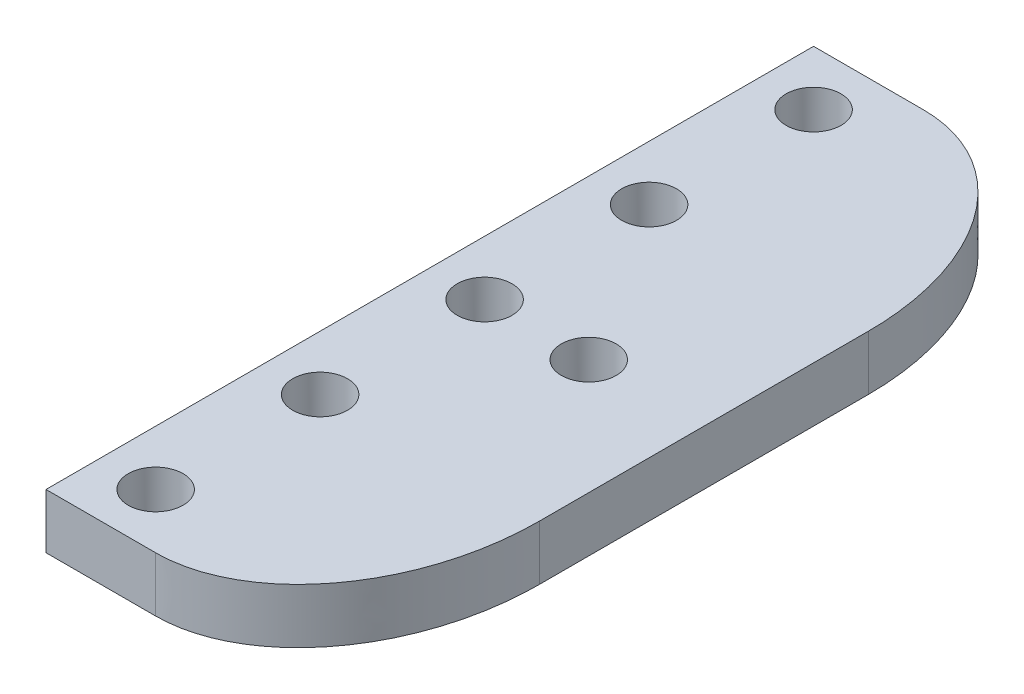
ISO-10303-21;
HEADER;
FILE_DESCRIPTION(('STEP AP214'),'2;1');
FILE_NAME('part.step','',(''),(''),'','','');
FILE_SCHEMA(('AUTOMOTIVE_DESIGN { 1 0 10303 214 1 1 1 1 }'));
ENDSEC;
DATA;
#1=APPLICATION_CONTEXT('core data for automotive mechanical design processes');
#2=APPLICATION_PROTOCOL_DEFINITION('international standard','automotive_design',2000,#1);
#3=PRODUCT_CONTEXT('',#1,'mechanical');
#4=PRODUCT('Part','Part','',(#3));
#5=PRODUCT_RELATED_PRODUCT_CATEGORY('part','',(#4));
#6=PRODUCT_DEFINITION_FORMATION('','',#4);
#7=PRODUCT_DEFINITION_CONTEXT('part definition',#1,'design');
#8=PRODUCT_DEFINITION('design','',#6,#7);
#9=PRODUCT_DEFINITION_SHAPE('','',#8);
#10=(LENGTH_UNIT() NAMED_UNIT(*) SI_UNIT(.MILLI.,.METRE.));
#11=(NAMED_UNIT(*) PLANE_ANGLE_UNIT() SI_UNIT($,.RADIAN.));
#12=(NAMED_UNIT(*) SI_UNIT($,.STERADIAN.) SOLID_ANGLE_UNIT());
#13=UNCERTAINTY_MEASURE_WITH_UNIT(LENGTH_MEASURE(1.E-05),#10,'distance_accuracy_value','');
#14=(GEOMETRIC_REPRESENTATION_CONTEXT(3) GLOBAL_UNCERTAINTY_ASSIGNED_CONTEXT((#13)) GLOBAL_UNIT_ASSIGNED_CONTEXT((#10,
#11,#12)) REPRESENTATION_CONTEXT('',''));
#15=CARTESIAN_POINT('',(0.,0.,0.));
#16=DIRECTION('',(0.,0.,1.));
#17=DIRECTION('',(1.,0.,0.));
#18=AXIS2_PLACEMENT_3D('',#15,#16,#17);
#19=CARTESIAN_POINT('',(12.5,-2.5,70.));
#20=DIRECTION('',(-1.,0.,0.));
#21=DIRECTION('',(0.,0.,1.));
#22=AXIS2_PLACEMENT_3D('',#19,#20,#21);
#23=PLANE('',#22);
#24=DIRECTION('',(0.,0.,-1.));
#25=VECTOR('',#24,1.);
#26=CARTESIAN_POINT('',(12.5,2.5,70.));
#27=LINE('',#26,#25);
#28=CARTESIAN_POINT('',(12.5,2.5,50.));
#29=VERTEX_POINT('',#28);
#30=CARTESIAN_POINT('',(12.5,2.5,20.));
#31=VERTEX_POINT('',#30);
#32=EDGE_CURVE('E120',#29,#31,#27,.T.);
#33=ORIENTED_EDGE('',*,*,#32,.F.);
#34=CARTESIAN_POINT('',(12.5,-2.75,50.));
#35=CARTESIAN_POINT('',(12.5,-0.916666666666667,50.));
#36=CARTESIAN_POINT('',(12.5,0.916666666666667,50.));
#37=CARTESIAN_POINT('',(12.5,2.75,50.));
#38=(BOUNDED_CURVE() B_SPLINE_CURVE(3,(#34,#35,#36,#37),.UNSPECIFIED.,.F.,
.F.) B_SPLINE_CURVE_WITH_KNOTS((4,4),(-0.00275,0.00275),
.UNSPECIFIED.) CURVE() GEOMETRIC_REPRESENTATION_ITEM() RATIONAL_B_SPLINE_CURVE((1.,1.,1.,1.)) REPRESENTATION_ITEM(''));
#39=CARTESIAN_POINT('',(12.5,-2.5,50.));
#40=VERTEX_POINT('',#39);
#41=EDGE_CURVE('E221',#29,#40,#38,.F.);
#42=ORIENTED_EDGE('',*,*,#41,.T.);
#43=DIRECTION('',(0.,0.,-1.));
#44=VECTOR('',#43,1.);
#45=CARTESIAN_POINT('',(12.5,-2.5,70.));
#46=LINE('',#45,#44);
#47=CARTESIAN_POINT('',(12.5,-2.5,20.));
#48=VERTEX_POINT('',#47);
#49=EDGE_CURVE('E128',#40,#48,#46,.T.);
#50=ORIENTED_EDGE('',*,*,#49,.T.);
#51=CARTESIAN_POINT('',(12.5,2.75,20.));
#52=CARTESIAN_POINT('',(12.5,0.916666666666669,20.));
#53=CARTESIAN_POINT('',(12.5,-0.916666666666669,20.));
#54=CARTESIAN_POINT('',(12.5,-2.75,20.));
#55=(BOUNDED_CURVE() B_SPLINE_CURVE(3,(#51,#52,#53,#54),.UNSPECIFIED.,.F.,
.F.) B_SPLINE_CURVE_WITH_KNOTS((4,4),(-0.00525,0.00025),
.UNSPECIFIED.) CURVE() GEOMETRIC_REPRESENTATION_ITEM() RATIONAL_B_SPLINE_CURVE((1.,1.,1.,1.)) REPRESENTATION_ITEM(''));
#56=EDGE_CURVE('E244',#48,#31,#55,.F.);
#57=ORIENTED_EDGE('',*,*,#56,.T.);
#58=EDGE_LOOP('',(#33,#42,#50,#57));
#59=FACE_BOUND('',#58,.T.);
#60=ADVANCED_FACE('F39',(#59),#23,.F.);
#61=CARTESIAN_POINT('',(-12.5,2.5,70.));
#62=DIRECTION('',(0.,-1.,0.));
#63=DIRECTION('',(0.,0.,-1.));
#64=AXIS2_PLACEMENT_3D('',#61,#62,#63);
#65=PLANE('',#64);
#66=CARTESIAN_POINT('',(-7.5,2.5,5.));
#67=DIRECTION('',(0.,-1.,0.));
#68=DIRECTION('',(0.,0.,-1.));
#69=AXIS2_PLACEMENT_3D('',#66,#67,#68);
#70=CIRCLE('',#69,2.5);
#71=CARTESIAN_POINT('',(-7.5,2.5,2.5));
#72=VERTEX_POINT('',#71);
#73=EDGE_CURVE('E321',#72,#72,#70,.T.);
#74=ORIENTED_EDGE('',*,*,#73,.T.);
#75=EDGE_LOOP('',(#74));
#76=FACE_BOUND('',#75,.T.);
#77=CARTESIAN_POINT('',(-7.5,2.5,35.));
#78=DIRECTION('',(0.,-1.,0.));
#79=DIRECTION('',(0.,0.,-1.));
#80=AXIS2_PLACEMENT_3D('',#77,#78,#79);
#81=CIRCLE('',#80,2.5);
#82=CARTESIAN_POINT('',(-7.5,2.5,32.5));
#83=VERTEX_POINT('',#82);
#84=EDGE_CURVE('E323',#83,#83,#81,.T.);
#85=ORIENTED_EDGE('',*,*,#84,.T.);
#86=EDGE_LOOP('',(#85));
#87=FACE_BOUND('',#86,.T.);
#88=CARTESIAN_POINT('',(-7.5,2.5,65.));
#89=DIRECTION('',(0.,-1.,0.));
#90=DIRECTION('',(0.,0.,-1.));
#91=AXIS2_PLACEMENT_3D('',#88,#89,#90);
#92=CIRCLE('',#91,2.5);
#93=CARTESIAN_POINT('',(-7.5,2.5,62.5));
#94=VERTEX_POINT('',#93);
#95=EDGE_CURVE('E326',#94,#94,#92,.T.);
#96=ORIENTED_EDGE('',*,*,#95,.T.);
#97=EDGE_LOOP('',(#96));
#98=FACE_BOUND('',#97,.T.);
#99=CARTESIAN_POINT('',(-7.5,2.5,50.));
#100=DIRECTION('',(0.,-1.,0.));
#101=DIRECTION('',(0.,0.,-1.));
#102=AXIS2_PLACEMENT_3D('',#99,#100,#101);
#103=CIRCLE('',#102,2.5);
#104=CARTESIAN_POINT('',(-7.5,2.5,47.5));
#105=VERTEX_POINT('',#104);
#106=EDGE_CURVE('E331',#105,#105,#103,.T.);
#107=ORIENTED_EDGE('',*,*,#106,.T.);
#108=EDGE_LOOP('',(#107));
#109=FACE_BOUND('',#108,.T.);
#110=CARTESIAN_POINT('',(2.,2.5,35.));
#111=DIRECTION('',(0.,-1.,0.));
#112=DIRECTION('',(0.,0.,-1.));
#113=AXIS2_PLACEMENT_3D('',#110,#111,#112);
#114=CIRCLE('',#113,2.5);
#115=CARTESIAN_POINT('',(2.,2.5,32.5));
#116=VERTEX_POINT('',#115);
#117=EDGE_CURVE('E334',#116,#116,#114,.T.);
#118=ORIENTED_EDGE('',*,*,#117,.T.);
#119=EDGE_LOOP('',(#118));
#120=FACE_BOUND('',#119,.T.);
#121=CARTESIAN_POINT('',(-7.5,2.5,20.));
#122=DIRECTION('',(0.,-1.,0.));
#123=DIRECTION('',(0.,0.,-1.));
#124=AXIS2_PLACEMENT_3D('',#121,#122,#123);
#125=CIRCLE('',#124,2.5);
#126=CARTESIAN_POINT('',(-7.5,2.5,17.5));
#127=VERTEX_POINT('',#126);
#128=EDGE_CURVE('E337',#127,#127,#125,.T.);
#129=ORIENTED_EDGE('',*,*,#128,.T.);
#130=EDGE_LOOP('',(#129));
#131=FACE_BOUND('',#130,.T.);
#132=DIRECTION('',(-1.,0.,0.));
#133=VECTOR('',#132,1.);
#134=CARTESIAN_POINT('',(6.5,2.5,70.));
#135=LINE('',#134,#133);
#136=CARTESIAN_POINT('',(-2.5,2.5,70.));
#137=VERTEX_POINT('',#136);
#138=CARTESIAN_POINT('',(-12.5,2.5,70.));
#139=VERTEX_POINT('',#138);
#140=EDGE_CURVE('E101',#137,#139,#135,.T.);
#141=ORIENTED_EDGE('',*,*,#140,.F.);
#142=CARTESIAN_POINT('',(12.5,2.5,50.));
#143=CARTESIAN_POINT('',(12.5,2.5,70.));
#144=CARTESIAN_POINT('',(-2.5,2.5,70.));
#145=(BOUNDED_CURVE() B_SPLINE_CURVE(2,(#142,#143,#144),.UNSPECIFIED.,.F.,
.F.) B_SPLINE_CURVE_WITH_KNOTS((3,3),(0.,1.),
.UNSPECIFIED.) CURVE() GEOMETRIC_REPRESENTATION_ITEM() RATIONAL_B_SPLINE_CURVE((1.,
0.707106781186547,1.)) REPRESENTATION_ITEM(''));
#146=EDGE_CURVE('E177',#137,#29,#145,.F.);
#147=ORIENTED_EDGE('',*,*,#146,.T.);
#148=ORIENTED_EDGE('',*,*,#32,.T.);
#149=CARTESIAN_POINT('',(-2.5,2.5,0.));
#150=CARTESIAN_POINT('',(12.5,2.5,0.));
#151=CARTESIAN_POINT('',(12.5,2.5,20.));
#152=(BOUNDED_CURVE() B_SPLINE_CURVE(2,(#149,#150,#151),.UNSPECIFIED.,.F.,
.F.) B_SPLINE_CURVE_WITH_KNOTS((3,3),(0.,1.),
.UNSPECIFIED.) CURVE() GEOMETRIC_REPRESENTATION_ITEM() RATIONAL_B_SPLINE_CURVE((1.,
0.707106781186548,1.)) REPRESENTATION_ITEM(''));
#153=CARTESIAN_POINT('',(-2.5,2.5,0.));
#154=VERTEX_POINT('',#153);
#155=EDGE_CURVE('E233',#31,#154,#152,.F.);
#156=ORIENTED_EDGE('',*,*,#155,.T.);
#157=DIRECTION('',(-1.,0.,0.));
#158=VECTOR('',#157,1.);
#159=CARTESIAN_POINT('',(-12.5,2.5,0.));
#160=LINE('',#159,#158);
#161=CARTESIAN_POINT('',(-12.5,2.5,0.));
#162=VERTEX_POINT('',#161);
#163=EDGE_CURVE('E117',#154,#162,#160,.T.);
#164=ORIENTED_EDGE('',*,*,#163,.T.);
#165=DIRECTION('',(0.,0.,-1.));
#166=VECTOR('',#165,1.);
#167=CARTESIAN_POINT('',(-12.5,2.5,70.));
#168=LINE('',#167,#166);
#169=EDGE_CURVE('E115',#139,#162,#168,.T.);
#170=ORIENTED_EDGE('',*,*,#169,.F.);
#171=EDGE_LOOP('',(#141,#147,#148,#156,#164,#170));
#172=FACE_BOUND('',#171,.T.);
#173=ADVANCED_FACE('F116',(#76,#87,#98,#109,#120,#131,#172),#65,.F.);
#174=CARTESIAN_POINT('',(-12.5,-2.5,70.));
#175=DIRECTION('',(1.,0.,0.));
#176=DIRECTION('',(0.,0.,-1.));
#177=AXIS2_PLACEMENT_3D('',#174,#175,#176);
#178=PLANE('',#177);
#179=DIRECTION('',(0.,-1.,0.));
#180=VECTOR('',#179,1.);
#181=CARTESIAN_POINT('',(-12.5,-2.5,0.));
#182=LINE('',#181,#180);
#183=CARTESIAN_POINT('',(-12.5,-2.5,0.));
#184=VERTEX_POINT('',#183);
#185=EDGE_CURVE('E304',#162,#184,#182,.T.);
#186=ORIENTED_EDGE('',*,*,#185,.T.);
#187=DIRECTION('',(0.,0.,-1.));
#188=VECTOR('',#187,1.);
#189=CARTESIAN_POINT('',(-12.5,-2.5,70.));
#190=LINE('',#189,#188);
#191=CARTESIAN_POINT('',(-12.5,-2.5,70.));
#192=VERTEX_POINT('',#191);
#193=EDGE_CURVE('E121',#192,#184,#190,.T.);
#194=ORIENTED_EDGE('',*,*,#193,.F.);
#195=DIRECTION('',(0.,-1.,0.));
#196=VECTOR('',#195,1.);
#197=CARTESIAN_POINT('',(-12.5,-2.5,70.));
#198=LINE('',#197,#196);
#199=EDGE_CURVE('E106',#139,#192,#198,.T.);
#200=ORIENTED_EDGE('',*,*,#199,.F.);
#201=ORIENTED_EDGE('',*,*,#169,.T.);
#202=EDGE_LOOP('',(#186,#194,#200,#201));
#203=FACE_BOUND('',#202,.T.);
#204=ADVANCED_FACE('F123',(#203),#178,.F.);
#205=CARTESIAN_POINT('',(-12.5,-2.5,70.));
#206=DIRECTION('',(0.,1.,0.));
#207=DIRECTION('',(0.,0.,1.));
#208=AXIS2_PLACEMENT_3D('',#205,#206,#207);
#209=PLANE('',#208);
#210=CARTESIAN_POINT('',(-7.5,-2.5,5.));
#211=DIRECTION('',(0.,1.,0.));
#212=DIRECTION('',(0.,0.,1.));
#213=AXIS2_PLACEMENT_3D('',#210,#211,#212);
#214=CIRCLE('',#213,2.5);
#215=CARTESIAN_POINT('',(-7.5,-2.5,7.5));
#216=VERTEX_POINT('',#215);
#217=EDGE_CURVE('E340',#216,#216,#214,.T.);
#218=ORIENTED_EDGE('',*,*,#217,.T.);
#219=EDGE_LOOP('',(#218));
#220=FACE_BOUND('',#219,.T.);
#221=CARTESIAN_POINT('',(-7.5,-2.5,35.));
#222=DIRECTION('',(0.,1.,0.));
#223=DIRECTION('',(0.,0.,1.));
#224=AXIS2_PLACEMENT_3D('',#221,#222,#223);
#225=CIRCLE('',#224,2.5);
#226=CARTESIAN_POINT('',(-7.5,-2.5,37.5));
#227=VERTEX_POINT('',#226);
#228=EDGE_CURVE('E345',#227,#227,#225,.T.);
#229=ORIENTED_EDGE('',*,*,#228,.T.);
#230=EDGE_LOOP('',(#229));
#231=FACE_BOUND('',#230,.T.);
#232=CARTESIAN_POINT('',(-7.5,-2.5,65.));
#233=DIRECTION('',(0.,1.,0.));
#234=DIRECTION('',(0.,0.,1.));
#235=AXIS2_PLACEMENT_3D('',#232,#233,#234);
#236=CIRCLE('',#235,2.5);
#237=CARTESIAN_POINT('',(-7.5,-2.5,67.5));
#238=VERTEX_POINT('',#237);
#239=EDGE_CURVE('E341',#238,#238,#236,.T.);
#240=ORIENTED_EDGE('',*,*,#239,.T.);
#241=EDGE_LOOP('',(#240));
#242=FACE_BOUND('',#241,.T.);
#243=CARTESIAN_POINT('',(-7.5,-2.5,50.));
#244=DIRECTION('',(0.,1.,0.));
#245=DIRECTION('',(0.,0.,1.));
#246=AXIS2_PLACEMENT_3D('',#243,#244,#245);
#247=CIRCLE('',#246,2.5);
#248=CARTESIAN_POINT('',(-7.5,-2.5,52.5));
#249=VERTEX_POINT('',#248);
#250=EDGE_CURVE('E344',#249,#249,#247,.T.);
#251=ORIENTED_EDGE('',*,*,#250,.T.);
#252=EDGE_LOOP('',(#251));
#253=FACE_BOUND('',#252,.T.);
#254=CARTESIAN_POINT('',(2.,-2.5,35.));
#255=DIRECTION('',(0.,1.,0.));
#256=DIRECTION('',(0.,0.,1.));
#257=AXIS2_PLACEMENT_3D('',#254,#255,#256);
#258=CIRCLE('',#257,2.5);
#259=CARTESIAN_POINT('',(2.,-2.5,37.5));
#260=VERTEX_POINT('',#259);
#261=EDGE_CURVE('E348',#260,#260,#258,.T.);
#262=ORIENTED_EDGE('',*,*,#261,.T.);
#263=EDGE_LOOP('',(#262));
#264=FACE_BOUND('',#263,.T.);
#265=CARTESIAN_POINT('',(-7.5,-2.5,20.));
#266=DIRECTION('',(0.,1.,0.));
#267=DIRECTION('',(0.,0.,1.));
#268=AXIS2_PLACEMENT_3D('',#265,#266,#267);
#269=CIRCLE('',#268,2.5);
#270=CARTESIAN_POINT('',(-7.5,-2.5,22.5));
#271=VERTEX_POINT('',#270);
#272=EDGE_CURVE('E351',#271,#271,#269,.T.);
#273=ORIENTED_EDGE('',*,*,#272,.T.);
#274=EDGE_LOOP('',(#273));
#275=FACE_BOUND('',#274,.T.);
#276=ORIENTED_EDGE('',*,*,#49,.F.);
#277=CARTESIAN_POINT('',(-2.5,-2.5,70.));
#278=CARTESIAN_POINT('',(12.5,-2.5,70.));
#279=CARTESIAN_POINT('',(12.5,-2.5,50.));
#280=(BOUNDED_CURVE() B_SPLINE_CURVE(2,(#277,#278,#279),.UNSPECIFIED.,.F.,
.F.) B_SPLINE_CURVE_WITH_KNOTS((3,3),(0.,1.),
.UNSPECIFIED.) CURVE() GEOMETRIC_REPRESENTATION_ITEM() RATIONAL_B_SPLINE_CURVE((1.,
0.707106781186547,1.)) REPRESENTATION_ITEM(''));
#281=CARTESIAN_POINT('',(-2.5,-2.5,70.));
#282=VERTEX_POINT('',#281);
#283=EDGE_CURVE('E53',#40,#282,#280,.F.);
#284=ORIENTED_EDGE('',*,*,#283,.T.);
#285=DIRECTION('',(1.,0.,0.));
#286=VECTOR('',#285,1.);
#287=CARTESIAN_POINT('',(-12.5,-2.5,70.));
#288=LINE('',#287,#286);
#289=EDGE_CURVE('E126',#192,#282,#288,.T.);
#290=ORIENTED_EDGE('',*,*,#289,.F.);
#291=ORIENTED_EDGE('',*,*,#193,.T.);
#292=DIRECTION('',(1.,0.,0.));
#293=VECTOR('',#292,1.);
#294=CARTESIAN_POINT('',(-12.5,-2.5,0.));
#295=LINE('',#294,#293);
#296=CARTESIAN_POINT('',(-2.5,-2.5,0.));
#297=VERTEX_POINT('',#296);
#298=EDGE_CURVE('E112',#184,#297,#295,.T.);
#299=ORIENTED_EDGE('',*,*,#298,.T.);
#300=CARTESIAN_POINT('',(12.5,-2.5,20.));
#301=CARTESIAN_POINT('',(12.5,-2.5,0.));
#302=CARTESIAN_POINT('',(-2.5,-2.5,0.));
#303=(BOUNDED_CURVE() B_SPLINE_CURVE(2,(#300,#301,#302),.UNSPECIFIED.,.F.,
.F.) B_SPLINE_CURVE_WITH_KNOTS((3,3),(0.,1.),
.UNSPECIFIED.) CURVE() GEOMETRIC_REPRESENTATION_ITEM() RATIONAL_B_SPLINE_CURVE((1.,
0.707106781186548,1.)) REPRESENTATION_ITEM(''));
#304=EDGE_CURVE('E66',#297,#48,#303,.F.);
#305=ORIENTED_EDGE('',*,*,#304,.T.);
#306=EDGE_LOOP('',(#276,#284,#290,#291,#299,#305));
#307=FACE_BOUND('',#306,.T.);
#308=ADVANCED_FACE('F155',(#220,#231,#242,#253,#264,#275,#307),#209,.F.);
#309=CARTESIAN_POINT('',(0.,0.,70.));
#310=DIRECTION('',(0.,0.,-1.));
#311=DIRECTION('',(-1.,0.,0.));
#312=AXIS2_PLACEMENT_3D('',#309,#310,#311);
#313=PLANE('',#312);
#314=ORIENTED_EDGE('',*,*,#289,.T.);
#315=CARTESIAN_POINT('',(-2.5,2.75,70.));
#316=CARTESIAN_POINT('',(-2.5,0.916666666666667,70.));
#317=CARTESIAN_POINT('',(-2.5,-0.916666666666667,70.));
#318=CARTESIAN_POINT('',(-2.5,-2.75,70.));
#319=(BOUNDED_CURVE() B_SPLINE_CURVE(3,(#315,#316,#317,#318),.UNSPECIFIED.,.F.,
.F.) B_SPLINE_CURVE_WITH_KNOTS((4,4),(-0.00275,0.00275),
.UNSPECIFIED.) CURVE() GEOMETRIC_REPRESENTATION_ITEM() RATIONAL_B_SPLINE_CURVE((1.,1.,1.,1.)) REPRESENTATION_ITEM(''));
#320=EDGE_CURVE('E109',#282,#137,#319,.F.);
#321=ORIENTED_EDGE('',*,*,#320,.T.);
#322=ORIENTED_EDGE('',*,*,#140,.T.);
#323=ORIENTED_EDGE('',*,*,#199,.T.);
#324=EDGE_LOOP('',(#314,#321,#322,#323));
#325=FACE_BOUND('',#324,.T.);
#326=ADVANCED_FACE('F104',(#325),#313,.F.);
#327=CARTESIAN_POINT('',(0.,0.,0.));
#328=DIRECTION('',(0.,0.,-1.));
#329=DIRECTION('',(-1.,0.,0.));
#330=AXIS2_PLACEMENT_3D('',#327,#328,#329);
#331=PLANE('',#330);
#332=ORIENTED_EDGE('',*,*,#163,.F.);
#333=CARTESIAN_POINT('',(-2.5,-2.75,0.));
#334=CARTESIAN_POINT('',(-2.5,-0.916666666666669,0.));
#335=CARTESIAN_POINT('',(-2.5,0.916666666666669,0.));
#336=CARTESIAN_POINT('',(-2.5,2.75,0.));
#337=(BOUNDED_CURVE() B_SPLINE_CURVE(3,(#333,#334,#335,#336),.UNSPECIFIED.,.F.,
.F.) B_SPLINE_CURVE_WITH_KNOTS((4,4),(-0.00525,0.00025),
.UNSPECIFIED.) CURVE() GEOMETRIC_REPRESENTATION_ITEM() RATIONAL_B_SPLINE_CURVE((1.,1.,1.,1.)) REPRESENTATION_ITEM(''));
#338=EDGE_CURVE('E12',#154,#297,#337,.F.);
#339=ORIENTED_EDGE('',*,*,#338,.T.);
#340=ORIENTED_EDGE('',*,*,#298,.F.);
#341=ORIENTED_EDGE('',*,*,#185,.F.);
#342=EDGE_LOOP('',(#332,#339,#340,#341));
#343=FACE_BOUND('',#342,.T.);
#344=ADVANCED_FACE('F154',(#343),#331,.T.);
#345=CARTESIAN_POINT('',(-7.5,-2.5,20.));
#346=DIRECTION('',(0.,1.,0.));
#347=DIRECTION('',(0.,0.,1.));
#348=AXIS2_PLACEMENT_3D('',#345,#346,#347);
#349=CYLINDRICAL_SURFACE('',#348,2.5);
#350=ORIENTED_EDGE('',*,*,#272,.F.);
#351=EDGE_LOOP('',(#350));
#352=FACE_BOUND('',#351,.T.);
#353=ORIENTED_EDGE('',*,*,#128,.F.);
#354=EDGE_LOOP('',(#353));
#355=FACE_BOUND('',#354,.T.);
#356=ADVANCED_FACE('F161',(#352,#355),#349,.F.);
#357=CARTESIAN_POINT('',(2.,-2.5,35.));
#358=DIRECTION('',(0.,1.,0.));
#359=DIRECTION('',(0.,0.,1.));
#360=AXIS2_PLACEMENT_3D('',#357,#358,#359);
#361=CYLINDRICAL_SURFACE('',#360,2.5);
#362=ORIENTED_EDGE('',*,*,#261,.F.);
#363=EDGE_LOOP('',(#362));
#364=FACE_BOUND('',#363,.T.);
#365=ORIENTED_EDGE('',*,*,#117,.F.);
#366=EDGE_LOOP('',(#365));
#367=FACE_BOUND('',#366,.T.);
#368=ADVANCED_FACE('F373',(#364,#367),#361,.F.);
#369=CARTESIAN_POINT('',(-7.5,-2.5,50.));
#370=DIRECTION('',(0.,1.,0.));
#371=DIRECTION('',(0.,0.,1.));
#372=AXIS2_PLACEMENT_3D('',#369,#370,#371);
#373=CYLINDRICAL_SURFACE('',#372,2.5);
#374=ORIENTED_EDGE('',*,*,#250,.F.);
#375=EDGE_LOOP('',(#374));
#376=FACE_BOUND('',#375,.T.);
#377=ORIENTED_EDGE('',*,*,#106,.F.);
#378=EDGE_LOOP('',(#377));
#379=FACE_BOUND('',#378,.T.);
#380=ADVANCED_FACE('F376',(#376,#379),#373,.F.);
#381=CARTESIAN_POINT('',(-7.5,-2.5,65.));
#382=DIRECTION('',(0.,1.,0.));
#383=DIRECTION('',(0.,0.,1.));
#384=AXIS2_PLACEMENT_3D('',#381,#382,#383);
#385=CYLINDRICAL_SURFACE('',#384,2.5);
#386=ORIENTED_EDGE('',*,*,#239,.F.);
#387=EDGE_LOOP('',(#386));
#388=FACE_BOUND('',#387,.T.);
#389=ORIENTED_EDGE('',*,*,#95,.F.);
#390=EDGE_LOOP('',(#389));
#391=FACE_BOUND('',#390,.T.);
#392=ADVANCED_FACE('F156',(#388,#391),#385,.F.);
#393=CARTESIAN_POINT('',(-7.5,-2.5,35.));
#394=DIRECTION('',(0.,1.,0.));
#395=DIRECTION('',(0.,0.,1.));
#396=AXIS2_PLACEMENT_3D('',#393,#394,#395);
#397=CYLINDRICAL_SURFACE('',#396,2.5);
#398=ORIENTED_EDGE('',*,*,#228,.F.);
#399=EDGE_LOOP('',(#398));
#400=FACE_BOUND('',#399,.T.);
#401=ORIENTED_EDGE('',*,*,#84,.F.);
#402=EDGE_LOOP('',(#401));
#403=FACE_BOUND('',#402,.T.);
#404=ADVANCED_FACE('F363',(#400,#403),#397,.F.);
#405=CARTESIAN_POINT('',(-7.5,-2.5,5.));
#406=DIRECTION('',(0.,1.,0.));
#407=DIRECTION('',(0.,0.,1.));
#408=AXIS2_PLACEMENT_3D('',#405,#406,#407);
#409=CYLINDRICAL_SURFACE('',#408,2.5);
#410=ORIENTED_EDGE('',*,*,#217,.F.);
#411=EDGE_LOOP('',(#410));
#412=FACE_BOUND('',#411,.T.);
#413=ORIENTED_EDGE('',*,*,#73,.F.);
#414=EDGE_LOOP('',(#413));
#415=FACE_BOUND('',#414,.T.);
#416=ADVANCED_FACE('F196',(#412,#415),#409,.F.);
#417=CARTESIAN_POINT('',(-2.5,-2.75,70.));
#418=CARTESIAN_POINT('',(-2.5,-0.916666666666667,70.));
#419=CARTESIAN_POINT('',(-2.5,0.916666666666667,70.));
#420=CARTESIAN_POINT('',(-2.5,2.75,70.));
#421=CARTESIAN_POINT('',(12.5,-2.75,70.));
#422=CARTESIAN_POINT('',(12.5,-0.916666666666668,70.));
#423=CARTESIAN_POINT('',(12.5,0.916666666666667,70.));
#424=CARTESIAN_POINT('',(12.5,2.75,70.));
#425=CARTESIAN_POINT('',(12.5,-2.75,50.));
#426=CARTESIAN_POINT('',(12.5,-0.916666666666667,50.));
#427=CARTESIAN_POINT('',(12.5,0.916666666666667,50.));
#428=CARTESIAN_POINT('',(12.5,2.75,50.));
#429=(BOUNDED_SURFACE() B_SPLINE_SURFACE(2,3,((#417,#418,#419,#420),(#421,#422,#423,#424),(#425,
#426,#427,#428)),.UNSPECIFIED.,.F.,.F.,.F.) B_SPLINE_SURFACE_WITH_KNOTS((3,3),(4,4),(0.,1.),
(-0.00275,0.00275),
.UNSPECIFIED.) GEOMETRIC_REPRESENTATION_ITEM() RATIONAL_B_SPLINE_SURFACE(((1.,1.,1.,1.),
(0.707106781186547,0.707106781186547,0.707106781186547,0.707106781186547),(1.,1.,1.,1.))) REPRESENTATION_ITEM('') SURFACE());
#430=ORIENTED_EDGE('',*,*,#283,.F.);
#431=ORIENTED_EDGE('',*,*,#41,.F.);
#432=ORIENTED_EDGE('',*,*,#146,.F.);
#433=ORIENTED_EDGE('',*,*,#320,.F.);
#434=EDGE_LOOP('',(#430,#431,#432,#433));
#435=FACE_BOUND('',#434,.T.);
#436=ADVANCED_FACE('F183',(#435),#429,.T.);
#437=CARTESIAN_POINT('',(-2.5,2.75,0.));
#438=CARTESIAN_POINT('',(-2.5,0.916666666666669,0.));
#439=CARTESIAN_POINT('',(-2.5,-0.916666666666669,0.));
#440=CARTESIAN_POINT('',(-2.5,-2.75,0.));
#441=CARTESIAN_POINT('',(12.5,2.75,0.));
#442=CARTESIAN_POINT('',(12.5,0.916666666666669,0.));
#443=CARTESIAN_POINT('',(12.5,-0.916666666666669,0.));
#444=CARTESIAN_POINT('',(12.5,-2.75,0.));
#445=CARTESIAN_POINT('',(12.5,2.75,20.));
#446=CARTESIAN_POINT('',(12.5,0.916666666666669,20.));
#447=CARTESIAN_POINT('',(12.5,-0.916666666666669,20.));
#448=CARTESIAN_POINT('',(12.5,-2.75,20.));
#449=(BOUNDED_SURFACE() B_SPLINE_SURFACE(2,3,((#437,#438,#439,#440),(#441,#442,#443,#444),(#445,
#446,#447,#448)),.UNSPECIFIED.,.F.,.F.,.F.) B_SPLINE_SURFACE_WITH_KNOTS((3,3),(4,4),(0.,1.),
(-0.00525,0.00025),
.UNSPECIFIED.) GEOMETRIC_REPRESENTATION_ITEM() RATIONAL_B_SPLINE_SURFACE(((1.,1.,1.,1.),
(0.707106781186548,0.707106781186548,0.707106781186548,0.707106781186548),(1.,1.,1.,1.))) REPRESENTATION_ITEM('') SURFACE());
#450=ORIENTED_EDGE('',*,*,#304,.F.);
#451=ORIENTED_EDGE('',*,*,#338,.F.);
#452=ORIENTED_EDGE('',*,*,#155,.F.);
#453=ORIENTED_EDGE('',*,*,#56,.F.);
#454=EDGE_LOOP('',(#450,#451,#452,#453));
#455=FACE_BOUND('',#454,.T.);
#456=ADVANCED_FACE('F42',(#455),#449,.T.);
#457=CLOSED_SHELL('',(#60,#173,#204,#308,#326,#344,#356,#368,#380,#392,#404,#416,#436,#456));
#458=MANIFOLD_SOLID_BREP('B2',#457);
#459=ADVANCED_BREP_SHAPE_REPRESENTATION('',(#18,#458),#14);
#460=SHAPE_DEFINITION_REPRESENTATION(#9,#459);
ENDSEC;
END-ISO-10303-21;
